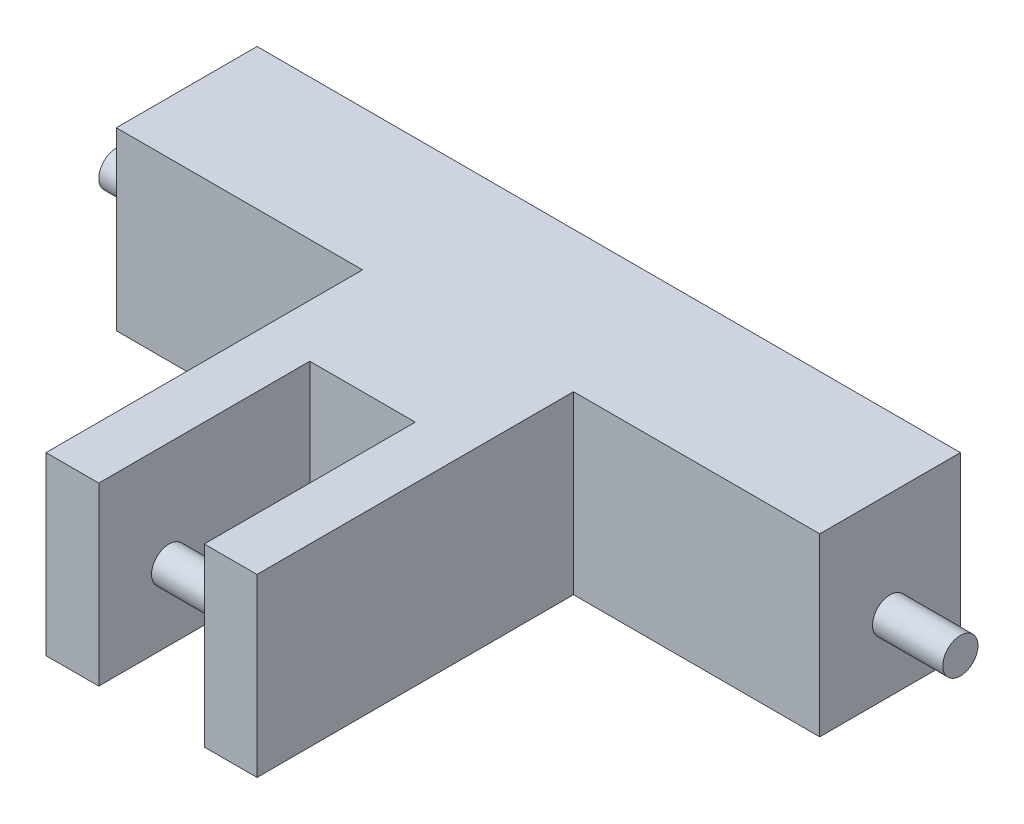
ISO-10303-21;
HEADER;
FILE_DESCRIPTION(('STEP AP214'),'2;1');
FILE_NAME('part.step','',(''),(''),'','','');
FILE_SCHEMA(('AUTOMOTIVE_DESIGN { 1 0 10303 214 1 1 1 1 }'));
ENDSEC;
DATA;
#1=APPLICATION_CONTEXT('core data for automotive mechanical design processes');
#2=APPLICATION_PROTOCOL_DEFINITION('international standard','automotive_design',2000,#1);
#3=PRODUCT_CONTEXT('',#1,'mechanical');
#4=PRODUCT('Part','Part','',(#3));
#5=PRODUCT_RELATED_PRODUCT_CATEGORY('part','',(#4));
#6=PRODUCT_DEFINITION_FORMATION('','',#4);
#7=PRODUCT_DEFINITION_CONTEXT('part definition',#1,'design');
#8=PRODUCT_DEFINITION('design','',#6,#7);
#9=PRODUCT_DEFINITION_SHAPE('','',#8);
#10=(LENGTH_UNIT() NAMED_UNIT(*) SI_UNIT(.MILLI.,.METRE.));
#11=(NAMED_UNIT(*) PLANE_ANGLE_UNIT() SI_UNIT($,.RADIAN.));
#12=(NAMED_UNIT(*) SI_UNIT($,.STERADIAN.) SOLID_ANGLE_UNIT());
#13=UNCERTAINTY_MEASURE_WITH_UNIT(LENGTH_MEASURE(1.E-05),#10,'distance_accuracy_value','');
#14=(GEOMETRIC_REPRESENTATION_CONTEXT(3) GLOBAL_UNCERTAINTY_ASSIGNED_CONTEXT((#13)) GLOBAL_UNIT_ASSIGNED_CONTEXT((#10,
#11,#12)) REPRESENTATION_CONTEXT('',''));
#15=CARTESIAN_POINT('',(0.,0.,0.));
#16=DIRECTION('',(0.,0.,1.));
#17=DIRECTION('',(1.,0.,0.));
#18=AXIS2_PLACEMENT_3D('',#15,#16,#17);
#19=CARTESIAN_POINT('',(15.,25.,45.));
#20=DIRECTION('',(0.,0.,-1.));
#21=DIRECTION('',(-1.,0.,0.));
#22=AXIS2_PLACEMENT_3D('',#19,#20,#21);
#23=PLANE('',#22);
#24=DIRECTION('',(1.,0.,0.));
#25=VECTOR('',#24,1.);
#26=CARTESIAN_POINT('',(15.,0.,45.));
#27=LINE('',#26,#25);
#28=CARTESIAN_POINT('',(-15.,0.,45.));
#29=VERTEX_POINT('',#28);
#30=CARTESIAN_POINT('',(-7.50000000000001,0.,45.));
#31=VERTEX_POINT('',#30);
#32=EDGE_CURVE('E152',#29,#31,#27,.T.);
#33=ORIENTED_EDGE('',*,*,#32,.T.);
#34=DIRECTION('',(0.,-1.,0.));
#35=VECTOR('',#34,1.);
#36=CARTESIAN_POINT('',(-7.50000000000001,0.,45.));
#37=LINE('',#36,#35);
#38=CARTESIAN_POINT('',(-7.50000000000001,25.,45.));
#39=VERTEX_POINT('',#38);
#40=EDGE_CURVE('E256',#39,#31,#37,.T.);
#41=ORIENTED_EDGE('',*,*,#40,.F.);
#42=DIRECTION('',(1.,0.,0.));
#43=VECTOR('',#42,1.);
#44=CARTESIAN_POINT('',(15.,25.,45.));
#45=LINE('',#44,#43);
#46=CARTESIAN_POINT('',(-15.,25.,45.));
#47=VERTEX_POINT('',#46);
#48=EDGE_CURVE('E233',#47,#39,#45,.T.);
#49=ORIENTED_EDGE('',*,*,#48,.F.);
#50=DIRECTION('',(0.,-1.,0.));
#51=VECTOR('',#50,1.);
#52=CARTESIAN_POINT('',(-15.,25.,45.));
#53=LINE('',#52,#51);
#54=EDGE_CURVE('E168',#47,#29,#53,.T.);
#55=ORIENTED_EDGE('',*,*,#54,.T.);
#56=EDGE_LOOP('',(#33,#41,#49,#55));
#57=FACE_BOUND('',#56,.T.);
#58=ADVANCED_FACE('F33',(#57),#23,.F.);
#59=CARTESIAN_POINT('',(-50.,25.,0.));
#60=DIRECTION('',(1.,0.,0.));
#61=DIRECTION('',(0.,0.,-1.));
#62=AXIS2_PLACEMENT_3D('',#59,#60,#61);
#63=PLANE('',#62);
#64=CARTESIAN_POINT('',(-50.,10.,-10.));
#65=DIRECTION('',(1.,0.,0.));
#66=DIRECTION('',(0.,0.,-1.));
#67=AXIS2_PLACEMENT_3D('',#64,#65,#66);
#68=CIRCLE('',#67,2.5);
#69=CARTESIAN_POINT('',(-50.,10.,-12.5));
#70=VERTEX_POINT('',#69);
#71=EDGE_CURVE('E266',#70,#70,#68,.T.);
#72=ORIENTED_EDGE('',*,*,#71,.T.);
#73=EDGE_LOOP('',(#72));
#74=FACE_BOUND('',#73,.T.);
#75=DIRECTION('',(0.,0.,1.));
#76=VECTOR('',#75,1.);
#77=CARTESIAN_POINT('',(-50.,0.,0.));
#78=LINE('',#77,#76);
#79=CARTESIAN_POINT('',(-50.,0.,-20.));
#80=VERTEX_POINT('',#79);
#81=CARTESIAN_POINT('',(-50.,0.,0.));
#82=VERTEX_POINT('',#81);
#83=EDGE_CURVE('E143',#80,#82,#78,.T.);
#84=ORIENTED_EDGE('',*,*,#83,.T.);
#85=DIRECTION('',(0.,-1.,0.));
#86=VECTOR('',#85,1.);
#87=CARTESIAN_POINT('',(-50.,25.,0.));
#88=LINE('',#87,#86);
#89=CARTESIAN_POINT('',(-50.,25.,0.));
#90=VERTEX_POINT('',#89);
#91=EDGE_CURVE('E174',#90,#82,#88,.T.);
#92=ORIENTED_EDGE('',*,*,#91,.F.);
#93=DIRECTION('',(0.,0.,1.));
#94=VECTOR('',#93,1.);
#95=CARTESIAN_POINT('',(-50.,25.,0.));
#96=LINE('',#95,#94);
#97=CARTESIAN_POINT('',(-50.,25.,-20.));
#98=VERTEX_POINT('',#97);
#99=EDGE_CURVE('E161',#98,#90,#96,.T.);
#100=ORIENTED_EDGE('',*,*,#99,.F.);
#101=DIRECTION('',(0.,-1.,0.));
#102=VECTOR('',#101,1.);
#103=CARTESIAN_POINT('',(-50.,25.,-20.));
#104=LINE('',#103,#102);
#105=EDGE_CURVE('E139',#98,#80,#104,.T.);
#106=ORIENTED_EDGE('',*,*,#105,.T.);
#107=EDGE_LOOP('',(#84,#92,#100,#106));
#108=FACE_BOUND('',#107,.T.);
#109=ADVANCED_FACE('F35',(#74,#108),#63,.F.);
#110=CARTESIAN_POINT('',(-15.,25.,0.));
#111=DIRECTION('',(0.,0.,-1.));
#112=DIRECTION('',(-1.,0.,0.));
#113=AXIS2_PLACEMENT_3D('',#110,#111,#112);
#114=PLANE('',#113);
#115=DIRECTION('',(1.,0.,0.));
#116=VECTOR('',#115,1.);
#117=CARTESIAN_POINT('',(-15.,0.,0.));
#118=LINE('',#117,#116);
#119=CARTESIAN_POINT('',(-15.,0.,0.));
#120=VERTEX_POINT('',#119);
#121=EDGE_CURVE('E146',#82,#120,#118,.T.);
#122=ORIENTED_EDGE('',*,*,#121,.T.);
#123=DIRECTION('',(0.,-1.,0.));
#124=VECTOR('',#123,1.);
#125=CARTESIAN_POINT('',(-15.,25.,0.));
#126=LINE('',#125,#124);
#127=CARTESIAN_POINT('',(-15.,25.,0.));
#128=VERTEX_POINT('',#127);
#129=EDGE_CURVE('E171',#128,#120,#126,.T.);
#130=ORIENTED_EDGE('',*,*,#129,.F.);
#131=DIRECTION('',(1.,0.,0.));
#132=VECTOR('',#131,1.);
#133=CARTESIAN_POINT('',(-15.,25.,0.));
#134=LINE('',#133,#132);
#135=EDGE_CURVE('E99',#90,#128,#134,.T.);
#136=ORIENTED_EDGE('',*,*,#135,.F.);
#137=ORIENTED_EDGE('',*,*,#91,.T.);
#138=EDGE_LOOP('',(#122,#130,#136,#137));
#139=FACE_BOUND('',#138,.T.);
#140=ADVANCED_FACE('F249',(#139),#114,.F.);
#141=CARTESIAN_POINT('',(-15.,25.,45.));
#142=DIRECTION('',(1.,0.,0.));
#143=DIRECTION('',(0.,0.,-1.));
#144=AXIS2_PLACEMENT_3D('',#141,#142,#143);
#145=PLANE('',#144);
#146=DIRECTION('',(0.,0.,1.));
#147=VECTOR('',#146,1.);
#148=CARTESIAN_POINT('',(-15.,0.,45.));
#149=LINE('',#148,#147);
#150=EDGE_CURVE('E149',#120,#29,#149,.T.);
#151=ORIENTED_EDGE('',*,*,#150,.T.);
#152=ORIENTED_EDGE('',*,*,#54,.F.);
#153=DIRECTION('',(0.,0.,1.));
#154=VECTOR('',#153,1.);
#155=CARTESIAN_POINT('',(-15.,25.,45.));
#156=LINE('',#155,#154);
#157=EDGE_CURVE('E230',#128,#47,#156,.T.);
#158=ORIENTED_EDGE('',*,*,#157,.F.);
#159=ORIENTED_EDGE('',*,*,#129,.T.);
#160=EDGE_LOOP('',(#151,#152,#158,#159));
#161=FACE_BOUND('',#160,.T.);
#162=ADVANCED_FACE('F252',(#161),#145,.F.);
#163=CARTESIAN_POINT('',(7.5,25.,45.));
#164=VERTEX_POINT('',#163);
#165=CARTESIAN_POINT('',(15.,25.,45.));
#166=VERTEX_POINT('',#165);
#167=EDGE_CURVE('E232',#164,#166,#45,.T.);
#168=ORIENTED_EDGE('',*,*,#167,.F.);
#169=DIRECTION('',(0.,1.,0.));
#170=VECTOR('',#169,1.);
#171=CARTESIAN_POINT('',(7.50000000000001,0.,45.));
#172=LINE('',#171,#170);
#173=CARTESIAN_POINT('',(7.50000000000001,0.,45.));
#174=VERTEX_POINT('',#173);
#175=EDGE_CURVE('E222',#174,#164,#172,.T.);
#176=ORIENTED_EDGE('',*,*,#175,.F.);
#177=CARTESIAN_POINT('',(15.,0.,45.));
#178=VERTEX_POINT('',#177);
#179=EDGE_CURVE('E151',#174,#178,#27,.T.);
#180=ORIENTED_EDGE('',*,*,#179,.T.);
#181=DIRECTION('',(0.,-1.,0.));
#182=VECTOR('',#181,1.);
#183=CARTESIAN_POINT('',(15.,25.,45.));
#184=LINE('',#183,#182);
#185=EDGE_CURVE('E165',#166,#178,#184,.T.);
#186=ORIENTED_EDGE('',*,*,#185,.F.);
#187=EDGE_LOOP('',(#168,#176,#180,#186));
#188=FACE_BOUND('',#187,.T.);
#189=ADVANCED_FACE('F239',(#188),#23,.F.);
#190=CARTESIAN_POINT('',(15.,25.,0.));
#191=DIRECTION('',(-1.,0.,0.));
#192=DIRECTION('',(0.,0.,1.));
#193=AXIS2_PLACEMENT_3D('',#190,#191,#192);
#194=PLANE('',#193);
#195=DIRECTION('',(0.,0.,-1.));
#196=VECTOR('',#195,1.);
#197=CARTESIAN_POINT('',(15.,0.,0.));
#198=LINE('',#197,#196);
#199=CARTESIAN_POINT('',(15.,0.,0.));
#200=VERTEX_POINT('',#199);
#201=EDGE_CURVE('E155',#178,#200,#198,.T.);
#202=ORIENTED_EDGE('',*,*,#201,.T.);
#203=DIRECTION('',(0.,-1.,0.));
#204=VECTOR('',#203,1.);
#205=CARTESIAN_POINT('',(15.,25.,0.));
#206=LINE('',#205,#204);
#207=CARTESIAN_POINT('',(15.,25.,0.));
#208=VERTEX_POINT('',#207);
#209=EDGE_CURVE('E134',#208,#200,#206,.T.);
#210=ORIENTED_EDGE('',*,*,#209,.F.);
#211=DIRECTION('',(0.,0.,-1.));
#212=VECTOR('',#211,1.);
#213=CARTESIAN_POINT('',(15.,25.,0.));
#214=LINE('',#213,#212);
#215=EDGE_CURVE('E122',#166,#208,#214,.T.);
#216=ORIENTED_EDGE('',*,*,#215,.F.);
#217=ORIENTED_EDGE('',*,*,#185,.T.);
#218=EDGE_LOOP('',(#202,#210,#216,#217));
#219=FACE_BOUND('',#218,.T.);
#220=ADVANCED_FACE('F241',(#219),#194,.F.);
#221=CARTESIAN_POINT('',(50.,25.,0.));
#222=DIRECTION('',(0.,0.,-1.));
#223=DIRECTION('',(-1.,0.,0.));
#224=AXIS2_PLACEMENT_3D('',#221,#222,#223);
#225=PLANE('',#224);
#226=DIRECTION('',(1.,0.,0.));
#227=VECTOR('',#226,1.);
#228=CARTESIAN_POINT('',(50.,0.,0.));
#229=LINE('',#228,#227);
#230=CARTESIAN_POINT('',(50.,0.,0.));
#231=VERTEX_POINT('',#230);
#232=EDGE_CURVE('E131',#200,#231,#229,.T.);
#233=ORIENTED_EDGE('',*,*,#232,.T.);
#234=DIRECTION('',(0.,-1.,0.));
#235=VECTOR('',#234,1.);
#236=CARTESIAN_POINT('',(50.,25.,0.));
#237=LINE('',#236,#235);
#238=CARTESIAN_POINT('',(50.,25.,0.));
#239=VERTEX_POINT('',#238);
#240=EDGE_CURVE('E128',#239,#231,#237,.T.);
#241=ORIENTED_EDGE('',*,*,#240,.F.);
#242=DIRECTION('',(1.,0.,0.));
#243=VECTOR('',#242,1.);
#244=CARTESIAN_POINT('',(50.,25.,0.));
#245=LINE('',#244,#243);
#246=EDGE_CURVE('E114',#208,#239,#245,.T.);
#247=ORIENTED_EDGE('',*,*,#246,.F.);
#248=ORIENTED_EDGE('',*,*,#209,.T.);
#249=EDGE_LOOP('',(#233,#241,#247,#248));
#250=FACE_BOUND('',#249,.T.);
#251=ADVANCED_FACE('F129',(#250),#225,.F.);
#252=CARTESIAN_POINT('',(50.,25.,-20.));
#253=DIRECTION('',(-1.,0.,0.));
#254=DIRECTION('',(0.,0.,1.));
#255=AXIS2_PLACEMENT_3D('',#252,#253,#254);
#256=PLANE('',#255);
#257=CARTESIAN_POINT('',(50.,10.,-10.));
#258=DIRECTION('',(-1.,0.,0.));
#259=DIRECTION('',(0.,0.,1.));
#260=AXIS2_PLACEMENT_3D('',#257,#258,#259);
#261=CIRCLE('',#260,2.5);
#262=CARTESIAN_POINT('',(50.,10.,-7.5));
#263=VERTEX_POINT('',#262);
#264=EDGE_CURVE('E176',#263,#263,#261,.F.);
#265=ORIENTED_EDGE('',*,*,#264,.F.);
#266=EDGE_LOOP('',(#265));
#267=FACE_BOUND('',#266,.T.);
#268=DIRECTION('',(0.,0.,-1.));
#269=VECTOR('',#268,1.);
#270=CARTESIAN_POINT('',(50.,0.,-20.));
#271=LINE('',#270,#269);
#272=CARTESIAN_POINT('',(50.,0.,-20.));
#273=VERTEX_POINT('',#272);
#274=EDGE_CURVE('E158',#231,#273,#271,.T.);
#275=ORIENTED_EDGE('',*,*,#274,.T.);
#276=DIRECTION('',(0.,-1.,0.));
#277=VECTOR('',#276,1.);
#278=CARTESIAN_POINT('',(50.,25.,-20.));
#279=LINE('',#278,#277);
#280=CARTESIAN_POINT('',(50.,25.,-20.));
#281=VERTEX_POINT('',#280);
#282=EDGE_CURVE('E135',#281,#273,#279,.T.);
#283=ORIENTED_EDGE('',*,*,#282,.F.);
#284=DIRECTION('',(0.,0.,-1.));
#285=VECTOR('',#284,1.);
#286=CARTESIAN_POINT('',(50.,25.,-20.));
#287=LINE('',#286,#285);
#288=EDGE_CURVE('E119',#239,#281,#287,.T.);
#289=ORIENTED_EDGE('',*,*,#288,.F.);
#290=ORIENTED_EDGE('',*,*,#240,.T.);
#291=EDGE_LOOP('',(#275,#283,#289,#290));
#292=FACE_BOUND('',#291,.T.);
#293=ADVANCED_FACE('F137',(#267,#292),#256,.F.);
#294=CARTESIAN_POINT('',(-50.,25.,-20.));
#295=DIRECTION('',(0.,0.,1.));
#296=DIRECTION('',(1.,0.,0.));
#297=AXIS2_PLACEMENT_3D('',#294,#295,#296);
#298=PLANE('',#297);
#299=DIRECTION('',(-1.,0.,0.));
#300=VECTOR('',#299,1.);
#301=CARTESIAN_POINT('',(-50.,0.,-20.));
#302=LINE('',#301,#300);
#303=EDGE_CURVE('E90',#273,#80,#302,.T.);
#304=ORIENTED_EDGE('',*,*,#303,.T.);
#305=ORIENTED_EDGE('',*,*,#105,.F.);
#306=DIRECTION('',(-1.,0.,0.));
#307=VECTOR('',#306,1.);
#308=CARTESIAN_POINT('',(-50.,25.,-20.));
#309=LINE('',#308,#307);
#310=EDGE_CURVE('E57',#281,#98,#309,.T.);
#311=ORIENTED_EDGE('',*,*,#310,.F.);
#312=ORIENTED_EDGE('',*,*,#282,.T.);
#313=EDGE_LOOP('',(#304,#305,#311,#312));
#314=FACE_BOUND('',#313,.T.);
#315=ADVANCED_FACE('F243',(#314),#298,.F.);
#316=CARTESIAN_POINT('',(0.,25.,0.));
#317=DIRECTION('',(0.,-1.,0.));
#318=DIRECTION('',(0.,0.,-1.));
#319=AXIS2_PLACEMENT_3D('',#316,#317,#318);
#320=PLANE('',#319);
#321=ORIENTED_EDGE('',*,*,#48,.T.);
#322=DIRECTION('',(0.,0.,-1.));
#323=VECTOR('',#322,1.);
#324=CARTESIAN_POINT('',(-7.50000000000001,25.,0.));
#325=LINE('',#324,#323);
#326=CARTESIAN_POINT('',(-7.50000000000001,25.,15.));
#327=VERTEX_POINT('',#326);
#328=EDGE_CURVE('E147',#39,#327,#325,.T.);
#329=ORIENTED_EDGE('',*,*,#328,.T.);
#330=DIRECTION('',(1.,0.,0.));
#331=VECTOR('',#330,1.);
#332=CARTESIAN_POINT('',(0.,25.,15.));
#333=LINE('',#332,#331);
#334=CARTESIAN_POINT('',(7.5,25.,15.));
#335=VERTEX_POINT('',#334);
#336=EDGE_CURVE('E217',#327,#335,#333,.T.);
#337=ORIENTED_EDGE('',*,*,#336,.T.);
#338=DIRECTION('',(0.,0.,1.));
#339=VECTOR('',#338,1.);
#340=CARTESIAN_POINT('',(7.5,25.,0.));
#341=LINE('',#340,#339);
#342=EDGE_CURVE('E202',#335,#164,#341,.T.);
#343=ORIENTED_EDGE('',*,*,#342,.T.);
#344=ORIENTED_EDGE('',*,*,#167,.T.);
#345=ORIENTED_EDGE('',*,*,#215,.T.);
#346=ORIENTED_EDGE('',*,*,#246,.T.);
#347=ORIENTED_EDGE('',*,*,#288,.T.);
#348=ORIENTED_EDGE('',*,*,#310,.T.);
#349=ORIENTED_EDGE('',*,*,#99,.T.);
#350=ORIENTED_EDGE('',*,*,#135,.T.);
#351=ORIENTED_EDGE('',*,*,#157,.T.);
#352=EDGE_LOOP('',(#321,#329,#337,#343,#344,#345,#346,#347,#348,#349,#350,#351));
#353=FACE_BOUND('',#352,.T.);
#354=ADVANCED_FACE('F117',(#353),#320,.F.);
#355=CARTESIAN_POINT('',(0.,0.,0.));
#356=DIRECTION('',(0.,-1.,0.));
#357=DIRECTION('',(0.,0.,-1.));
#358=AXIS2_PLACEMENT_3D('',#355,#356,#357);
#359=PLANE('',#358);
#360=DIRECTION('',(0.,0.,1.));
#361=VECTOR('',#360,1.);
#362=CARTESIAN_POINT('',(-7.50000000000001,0.,15.));
#363=LINE('',#362,#361);
#364=CARTESIAN_POINT('',(-7.50000000000001,0.,15.));
#365=VERTEX_POINT('',#364);
#366=EDGE_CURVE('E48',#365,#31,#363,.T.);
#367=ORIENTED_EDGE('',*,*,#366,.T.);
#368=ORIENTED_EDGE('',*,*,#32,.F.);
#369=ORIENTED_EDGE('',*,*,#150,.F.);
#370=ORIENTED_EDGE('',*,*,#121,.F.);
#371=ORIENTED_EDGE('',*,*,#83,.F.);
#372=ORIENTED_EDGE('',*,*,#303,.F.);
#373=ORIENTED_EDGE('',*,*,#274,.F.);
#374=ORIENTED_EDGE('',*,*,#232,.F.);
#375=ORIENTED_EDGE('',*,*,#201,.F.);
#376=ORIENTED_EDGE('',*,*,#179,.F.);
#377=DIRECTION('',(0.,0.,1.));
#378=VECTOR('',#377,1.);
#379=CARTESIAN_POINT('',(7.50000000000001,0.,15.));
#380=LINE('',#379,#378);
#381=CARTESIAN_POINT('',(7.50000000000001,0.,15.));
#382=VERTEX_POINT('',#381);
#383=EDGE_CURVE('E199',#382,#174,#380,.T.);
#384=ORIENTED_EDGE('',*,*,#383,.F.);
#385=DIRECTION('',(1.,0.,0.));
#386=VECTOR('',#385,1.);
#387=CARTESIAN_POINT('',(-7.50000000000001,0.,15.));
#388=LINE('',#387,#386);
#389=EDGE_CURVE('E208',#365,#382,#388,.T.);
#390=ORIENTED_EDGE('',*,*,#389,.F.);
#391=EDGE_LOOP('',(#367,#368,#369,#370,#371,#372,#373,#374,#375,#376,#384,#390));
#392=FACE_BOUND('',#391,.T.);
#393=ADVANCED_FACE('F215',(#392),#359,.T.);
#394=CARTESIAN_POINT('',(-7.50000000000001,0.,15.));
#395=DIRECTION('',(-1.,0.,0.));
#396=DIRECTION('',(0.,0.,1.));
#397=AXIS2_PLACEMENT_3D('',#394,#395,#396);
#398=PLANE('',#397);
#399=CARTESIAN_POINT('',(-7.49999999999318,10.,35.));
#400=DIRECTION('',(-1.,0.,0.));
#401=DIRECTION('',(0.,0.,1.));
#402=AXIS2_PLACEMENT_3D('',#399,#400,#401);
#403=CIRCLE('',#402,2.5);
#404=CARTESIAN_POINT('',(-7.49999999999318,10.,37.5));
#405=VERTEX_POINT('',#404);
#406=EDGE_CURVE('E11',#405,#405,#403,.F.);
#407=ORIENTED_EDGE('',*,*,#406,.F.);
#408=EDGE_LOOP('',(#407));
#409=FACE_BOUND('',#408,.T.);
#410=ORIENTED_EDGE('',*,*,#40,.T.);
#411=ORIENTED_EDGE('',*,*,#366,.F.);
#412=DIRECTION('',(0.,-1.,0.));
#413=VECTOR('',#412,1.);
#414=CARTESIAN_POINT('',(-7.50000000000001,0.,15.));
#415=LINE('',#414,#413);
#416=EDGE_CURVE('E211',#327,#365,#415,.T.);
#417=ORIENTED_EDGE('',*,*,#416,.F.);
#418=ORIENTED_EDGE('',*,*,#328,.F.);
#419=EDGE_LOOP('',(#410,#411,#417,#418));
#420=FACE_BOUND('',#419,.T.);
#421=ADVANCED_FACE('F187',(#409,#420),#398,.F.);
#422=CARTESIAN_POINT('',(7.50000000000001,0.,15.));
#423=DIRECTION('',(1.,0.,0.));
#424=DIRECTION('',(0.,1.,0.));
#425=AXIS2_PLACEMENT_3D('',#422,#423,#424);
#426=PLANE('',#425);
#427=CARTESIAN_POINT('',(7.49999999999318,10.,35.));
#428=DIRECTION('',(1.,0.,0.));
#429=DIRECTION('',(0.,1.,0.));
#430=AXIS2_PLACEMENT_3D('',#427,#428,#429);
#431=CIRCLE('',#430,2.5);
#432=CARTESIAN_POINT('',(7.49999999999318,12.5,35.));
#433=VERTEX_POINT('',#432);
#434=EDGE_CURVE('E41',#433,#433,#431,.F.);
#435=ORIENTED_EDGE('',*,*,#434,.F.);
#436=EDGE_LOOP('',(#435));
#437=FACE_BOUND('',#436,.T.);
#438=DIRECTION('',(0.,1.,0.));
#439=VECTOR('',#438,1.);
#440=CARTESIAN_POINT('',(7.50000000000001,0.,15.));
#441=LINE('',#440,#439);
#442=EDGE_CURVE('E194',#382,#335,#441,.T.);
#443=ORIENTED_EDGE('',*,*,#442,.F.);
#444=ORIENTED_EDGE('',*,*,#383,.T.);
#445=ORIENTED_EDGE('',*,*,#175,.T.);
#446=ORIENTED_EDGE('',*,*,#342,.F.);
#447=EDGE_LOOP('',(#443,#444,#445,#446));
#448=FACE_BOUND('',#447,.T.);
#449=ADVANCED_FACE('F183',(#437,#448),#426,.F.);
#450=CARTESIAN_POINT('',(0.,0.,15.));
#451=DIRECTION('',(0.,0.,-1.));
#452=DIRECTION('',(-1.,0.,0.));
#453=AXIS2_PLACEMENT_3D('',#450,#451,#452);
#454=PLANE('',#453);
#455=ORIENTED_EDGE('',*,*,#416,.T.);
#456=ORIENTED_EDGE('',*,*,#389,.T.);
#457=ORIENTED_EDGE('',*,*,#442,.T.);
#458=ORIENTED_EDGE('',*,*,#336,.F.);
#459=EDGE_LOOP('',(#455,#456,#457,#458));
#460=FACE_BOUND('',#459,.T.);
#461=ADVANCED_FACE('F186',(#460),#454,.F.);
#462=CARTESIAN_POINT('',(60.,10.,-10.));
#463=DIRECTION('',(-1.,0.,0.));
#464=DIRECTION('',(0.,0.,1.));
#465=AXIS2_PLACEMENT_3D('',#462,#463,#464);
#466=CYLINDRICAL_SURFACE('',#465,2.5);
#467=CARTESIAN_POINT('',(60.,10.,-10.));
#468=DIRECTION('',(1.,0.,0.));
#469=DIRECTION('',(0.,0.,-1.));
#470=AXIS2_PLACEMENT_3D('',#467,#468,#469);
#471=CIRCLE('',#470,2.5);
#472=CARTESIAN_POINT('',(60.,10.,-12.5));
#473=VERTEX_POINT('',#472);
#474=EDGE_CURVE('E260',#473,#473,#471,.T.);
#475=ORIENTED_EDGE('',*,*,#474,.F.);
#476=EDGE_LOOP('',(#475));
#477=FACE_BOUND('',#476,.T.);
#478=ORIENTED_EDGE('',*,*,#264,.T.);
#479=EDGE_LOOP('',(#478));
#480=FACE_BOUND('',#479,.T.);
#481=ADVANCED_FACE('F355',(#477,#480),#466,.T.);
#482=CARTESIAN_POINT('',(60.,10.,-10.));
#483=DIRECTION('',(1.,0.,0.));
#484=DIRECTION('',(0.,0.,-1.));
#485=AXIS2_PLACEMENT_3D('',#482,#483,#484);
#486=PLANE('',#485);
#487=ORIENTED_EDGE('',*,*,#474,.T.);
#488=EDGE_LOOP('',(#487));
#489=FACE_BOUND('',#488,.T.);
#490=ADVANCED_FACE('F284',(#489),#486,.T.);
#491=CARTESIAN_POINT('',(-60.,10.,-10.));
#492=DIRECTION('',(1.,0.,0.));
#493=DIRECTION('',(0.,0.,-1.));
#494=AXIS2_PLACEMENT_3D('',#491,#492,#493);
#495=CYLINDRICAL_SURFACE('',#494,2.5);
#496=CARTESIAN_POINT('',(-60.,10.,-10.));
#497=DIRECTION('',(1.,0.,0.));
#498=DIRECTION('',(0.,0.,-1.));
#499=AXIS2_PLACEMENT_3D('',#496,#497,#498);
#500=CIRCLE('',#499,2.5);
#501=CARTESIAN_POINT('',(-60.,10.,-12.5));
#502=VERTEX_POINT('',#501);
#503=EDGE_CURVE('E262',#502,#502,#500,.T.);
#504=ORIENTED_EDGE('',*,*,#503,.T.);
#505=EDGE_LOOP('',(#504));
#506=FACE_BOUND('',#505,.T.);
#507=ORIENTED_EDGE('',*,*,#71,.F.);
#508=EDGE_LOOP('',(#507));
#509=FACE_BOUND('',#508,.T.);
#510=ADVANCED_FACE('F272',(#506,#509),#495,.T.);
#511=CARTESIAN_POINT('',(-60.,10.,-10.));
#512=DIRECTION('',(-1.,0.,0.));
#513=DIRECTION('',(0.,0.,-1.));
#514=AXIS2_PLACEMENT_3D('',#511,#512,#513);
#515=PLANE('',#514);
#516=ORIENTED_EDGE('',*,*,#503,.F.);
#517=EDGE_LOOP('',(#516));
#518=FACE_BOUND('',#517,.T.);
#519=ADVANCED_FACE('F275',(#518),#515,.T.);
#520=CARTESIAN_POINT('',(500000.,9.99999999997832,35.));
#521=DIRECTION('',(-1.,0.,0.));
#522=DIRECTION('',(0.,-1.,0.));
#523=AXIS2_PLACEMENT_3D('',#520,#521,#522);
#524=CYLINDRICAL_SURFACE('',#523,2.5);
#525=ORIENTED_EDGE('',*,*,#406,.T.);
#526=EDGE_LOOP('',(#525));
#527=FACE_BOUND('',#526,.T.);
#528=ORIENTED_EDGE('',*,*,#434,.T.);
#529=EDGE_LOOP('',(#528));
#530=FACE_BOUND('',#529,.T.);
#531=ADVANCED_FACE('F181',(#527,#530),#524,.T.);
#532=CLOSED_SHELL('',(#58,#109,#140,#162,#189,#220,#251,#293,#315,#354,#393,#421,#449,#461,#481,
#490,#510,#519,#531));
#533=MANIFOLD_SOLID_BREP('B2',#532);
#534=ADVANCED_BREP_SHAPE_REPRESENTATION('',(#18,#533),#14);
#535=SHAPE_DEFINITION_REPRESENTATION(#9,#534);
ENDSEC;
END-ISO-10303-21;
